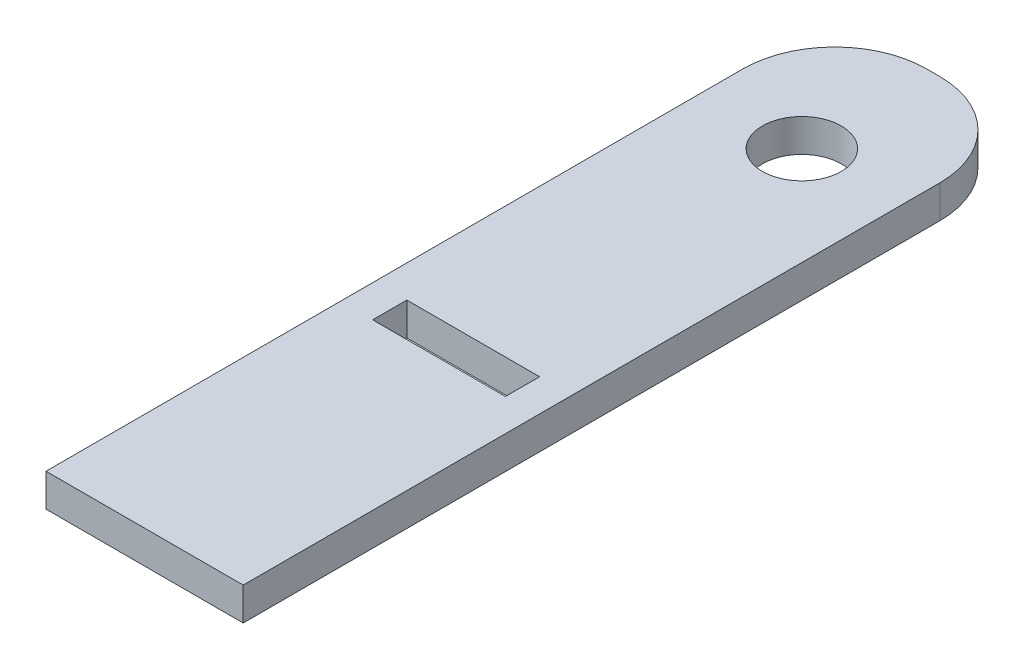
ISO-10303-21;
HEADER;
FILE_DESCRIPTION(('STEP AP214'),'2;1');
FILE_NAME('part.step','',(''),(''),'','','');
FILE_SCHEMA(('AUTOMOTIVE_DESIGN { 1 0 10303 214 1 1 1 1 }'));
ENDSEC;
DATA;
#1=APPLICATION_CONTEXT('core data for automotive mechanical design processes');
#2=APPLICATION_PROTOCOL_DEFINITION('international standard','automotive_design',2000,#1);
#3=PRODUCT_CONTEXT('',#1,'mechanical');
#4=PRODUCT('Part','Part','',(#3));
#5=PRODUCT_RELATED_PRODUCT_CATEGORY('part','',(#4));
#6=PRODUCT_DEFINITION_FORMATION('','',#4);
#7=PRODUCT_DEFINITION_CONTEXT('part definition',#1,'design');
#8=PRODUCT_DEFINITION('design','',#6,#7);
#9=PRODUCT_DEFINITION_SHAPE('','',#8);
#10=(LENGTH_UNIT() NAMED_UNIT(*) SI_UNIT(.MILLI.,.METRE.));
#11=(NAMED_UNIT(*) PLANE_ANGLE_UNIT() SI_UNIT($,.RADIAN.));
#12=(NAMED_UNIT(*) SI_UNIT($,.STERADIAN.) SOLID_ANGLE_UNIT());
#13=UNCERTAINTY_MEASURE_WITH_UNIT(LENGTH_MEASURE(1.E-05),#10,'distance_accuracy_value','');
#14=(GEOMETRIC_REPRESENTATION_CONTEXT(3) GLOBAL_UNCERTAINTY_ASSIGNED_CONTEXT((#13)) GLOBAL_UNIT_ASSIGNED_CONTEXT((#10,
#11,#12)) REPRESENTATION_CONTEXT('',''));
#15=CARTESIAN_POINT('',(0.,0.,0.));
#16=DIRECTION('',(0.,0.,1.));
#17=DIRECTION('',(1.,0.,0.));
#18=AXIS2_PLACEMENT_3D('',#15,#16,#17);
#19=CARTESIAN_POINT('',(-0.635,3.175,-29.21));
#20=DIRECTION('',(0.,1.,0.));
#21=DIRECTION('',(0.,0.,1.));
#22=AXIS2_PLACEMENT_3D('',#19,#20,#21);
#23=CYLINDRICAL_SURFACE('',#22,8.89);
#24=DIRECTION('',(0.,1.,0.));
#25=VECTOR('',#24,1.);
#26=CARTESIAN_POINT('',(-0.635,3.175,-38.1));
#27=LINE('',#26,#25);
#28=CARTESIAN_POINT('',(-0.635000000000004,0.,-38.1));
#29=VERTEX_POINT('',#28);
#30=CARTESIAN_POINT('',(-0.635000000000004,3.175,-38.1));
#31=VERTEX_POINT('',#30);
#32=EDGE_CURVE('E189',#29,#31,#27,.T.);
#33=ORIENTED_EDGE('',*,*,#32,.F.);
#34=CARTESIAN_POINT('',(-0.635,0.,-29.21));
#35=DIRECTION('',(0.,1.,0.));
#36=DIRECTION('',(0.,0.,1.));
#37=AXIS2_PLACEMENT_3D('',#34,#35,#36);
#38=CIRCLE('',#37,8.89);
#39=CARTESIAN_POINT('',(-9.525,0.,-29.21));
#40=VERTEX_POINT('',#39);
#41=EDGE_CURVE('E40',#40,#29,#38,.F.);
#42=ORIENTED_EDGE('',*,*,#41,.F.);
#43=DIRECTION('',(0.,1.,0.));
#44=VECTOR('',#43,1.);
#45=CARTESIAN_POINT('',(-9.525,3.175,-29.21));
#46=LINE('',#45,#44);
#47=CARTESIAN_POINT('',(-9.525,3.175,-29.21));
#48=VERTEX_POINT('',#47);
#49=EDGE_CURVE('E192',#48,#40,#46,.F.);
#50=ORIENTED_EDGE('',*,*,#49,.F.);
#51=CARTESIAN_POINT('',(-0.635,3.175,-29.21));
#52=DIRECTION('',(0.,1.,0.));
#53=DIRECTION('',(0.,0.,1.));
#54=AXIS2_PLACEMENT_3D('',#51,#52,#53);
#55=CIRCLE('',#54,8.89);
#56=EDGE_CURVE('E11',#31,#48,#55,.T.);
#57=ORIENTED_EDGE('',*,*,#56,.F.);
#58=EDGE_LOOP('',(#33,#42,#50,#57));
#59=FACE_BOUND('',#58,.T.);
#60=ADVANCED_FACE('F33',(#59),#23,.T.);
#61=CARTESIAN_POINT('',(0.635000000000004,3.175,-29.21));
#62=DIRECTION('',(0.,1.,0.));
#63=DIRECTION('',(0.,0.,1.));
#64=AXIS2_PLACEMENT_3D('',#61,#62,#63);
#65=CYLINDRICAL_SURFACE('',#64,8.89);
#66=DIRECTION('',(0.,1.,0.));
#67=VECTOR('',#66,1.);
#68=CARTESIAN_POINT('',(9.525,3.175,-29.21));
#69=LINE('',#68,#67);
#70=CARTESIAN_POINT('',(9.525,0.,-29.21));
#71=VERTEX_POINT('',#70);
#72=CARTESIAN_POINT('',(9.525,3.175,-29.21));
#73=VERTEX_POINT('',#72);
#74=EDGE_CURVE('E179',#71,#73,#69,.T.);
#75=ORIENTED_EDGE('',*,*,#74,.F.);
#76=CARTESIAN_POINT('',(0.635000000000004,0.,-29.21));
#77=DIRECTION('',(0.,1.,0.));
#78=DIRECTION('',(0.,0.,1.));
#79=AXIS2_PLACEMENT_3D('',#76,#77,#78);
#80=CIRCLE('',#79,8.89);
#81=CARTESIAN_POINT('',(0.635,0.,-38.1));
#82=VERTEX_POINT('',#81);
#83=EDGE_CURVE('E185',#82,#71,#80,.F.);
#84=ORIENTED_EDGE('',*,*,#83,.F.);
#85=DIRECTION('',(0.,1.,0.));
#86=VECTOR('',#85,1.);
#87=CARTESIAN_POINT('',(0.635000000000004,3.175,-38.1));
#88=LINE('',#87,#86);
#89=CARTESIAN_POINT('',(0.635,3.175,-38.1));
#90=VERTEX_POINT('',#89);
#91=EDGE_CURVE('E182',#90,#82,#88,.F.);
#92=ORIENTED_EDGE('',*,*,#91,.F.);
#93=CARTESIAN_POINT('',(0.635000000000004,3.175,-29.21));
#94=DIRECTION('',(0.,1.,0.));
#95=DIRECTION('',(0.,0.,1.));
#96=AXIS2_PLACEMENT_3D('',#93,#94,#95);
#97=CIRCLE('',#96,8.89);
#98=EDGE_CURVE('E187',#73,#90,#97,.T.);
#99=ORIENTED_EDGE('',*,*,#98,.F.);
#100=EDGE_LOOP('',(#75,#84,#92,#99));
#101=FACE_BOUND('',#100,.T.);
#102=ADVANCED_FACE('F205',(#101),#65,.T.);
#103=CARTESIAN_POINT('',(0.,3.175,0.));
#104=DIRECTION('',(0.,1.,0.));
#105=DIRECTION('',(0.,0.,1.));
#106=AXIS2_PLACEMENT_3D('',#103,#104,#105);
#107=PLANE('',#106);
#108=CARTESIAN_POINT('',(0.,3.175,-25.4));
#109=DIRECTION('',(0.,1.,0.));
#110=DIRECTION('',(0.,0.,1.));
#111=AXIS2_PLACEMENT_3D('',#108,#109,#110);
#112=CIRCLE('',#111,3.81);
#113=CARTESIAN_POINT('',(0.,3.175,-21.59));
#114=VERTEX_POINT('',#113);
#115=EDGE_CURVE('E149',#114,#114,#112,.T.);
#116=ORIENTED_EDGE('',*,*,#115,.F.);
#117=EDGE_LOOP('',(#116));
#118=FACE_BOUND('',#117,.T.);
#119=DIRECTION('',(-1.,0.,0.));
#120=VECTOR('',#119,1.);
#121=CARTESIAN_POINT('',(-9.525,3.175,-38.1));
#122=LINE('',#121,#120);
#123=EDGE_CURVE('E163',#90,#31,#122,.T.);
#124=ORIENTED_EDGE('',*,*,#123,.T.);
#125=ORIENTED_EDGE('',*,*,#56,.T.);
#126=DIRECTION('',(0.,0.,1.));
#127=VECTOR('',#126,1.);
#128=CARTESIAN_POINT('',(-9.525,3.175,-38.1));
#129=LINE('',#128,#127);
#130=CARTESIAN_POINT('',(-9.525,3.175,38.1));
#131=VERTEX_POINT('',#130);
#132=EDGE_CURVE('E155',#48,#131,#129,.T.);
#133=ORIENTED_EDGE('',*,*,#132,.T.);
#134=DIRECTION('',(1.,0.,0.));
#135=VECTOR('',#134,1.);
#136=CARTESIAN_POINT('',(-9.525,3.175,38.1));
#137=LINE('',#136,#135);
#138=CARTESIAN_POINT('',(9.525,3.175,38.1));
#139=VERTEX_POINT('',#138);
#140=EDGE_CURVE('E157',#131,#139,#137,.T.);
#141=ORIENTED_EDGE('',*,*,#140,.T.);
#142=DIRECTION('',(0.,0.,-1.));
#143=VECTOR('',#142,1.);
#144=CARTESIAN_POINT('',(9.525,3.175,-38.1));
#145=LINE('',#144,#143);
#146=EDGE_CURVE('E160',#139,#73,#145,.T.);
#147=ORIENTED_EDGE('',*,*,#146,.T.);
#148=ORIENTED_EDGE('',*,*,#98,.T.);
#149=EDGE_LOOP('',(#124,#125,#133,#141,#147,#148));
#150=FACE_BOUND('',#149,.T.);
#151=DIRECTION('',(1.,0.,0.));
#152=VECTOR('',#151,1.);
#153=CARTESIAN_POINT('',(-6.4135,3.175,9.652));
#154=LINE('',#153,#152);
#155=CARTESIAN_POINT('',(-6.4135,3.175,9.652));
#156=VERTEX_POINT('',#155);
#157=CARTESIAN_POINT('',(6.4135,3.175,9.652));
#158=VERTEX_POINT('',#157);
#159=EDGE_CURVE('E117',#156,#158,#154,.T.);
#160=ORIENTED_EDGE('',*,*,#159,.F.);
#161=DIRECTION('',(0.,0.,1.));
#162=VECTOR('',#161,1.);
#163=CARTESIAN_POINT('',(-6.4135,3.175,6.35));
#164=LINE('',#163,#162);
#165=CARTESIAN_POINT('',(-6.4135,3.175,6.35));
#166=VERTEX_POINT('',#165);
#167=EDGE_CURVE('E107',#166,#156,#164,.T.);
#168=ORIENTED_EDGE('',*,*,#167,.F.);
#169=DIRECTION('',(-1.,0.,0.));
#170=VECTOR('',#169,1.);
#171=CARTESIAN_POINT('',(-6.4135,3.175,6.35));
#172=LINE('',#171,#170);
#173=CARTESIAN_POINT('',(6.4135,3.175,6.35));
#174=VERTEX_POINT('',#173);
#175=EDGE_CURVE('E133',#174,#166,#172,.T.);
#176=ORIENTED_EDGE('',*,*,#175,.F.);
#177=DIRECTION('',(0.,0.,-1.));
#178=VECTOR('',#177,1.);
#179=CARTESIAN_POINT('',(6.4135,3.175,6.35));
#180=LINE('',#179,#178);
#181=EDGE_CURVE('E131',#158,#174,#180,.T.);
#182=ORIENTED_EDGE('',*,*,#181,.F.);
#183=EDGE_LOOP('',(#160,#168,#176,#182));
#184=FACE_BOUND('',#183,.T.);
#185=ADVANCED_FACE('F129',(#118,#150,#184),#107,.T.);
#186=CARTESIAN_POINT('',(0.,0.,0.));
#187=DIRECTION('',(0.,1.,0.));
#188=DIRECTION('',(0.,0.,1.));
#189=AXIS2_PLACEMENT_3D('',#186,#187,#188);
#190=PLANE('',#189);
#191=CARTESIAN_POINT('',(0.,0.,-25.4));
#192=DIRECTION('',(0.,1.,0.));
#193=DIRECTION('',(0.,0.,1.));
#194=AXIS2_PLACEMENT_3D('',#191,#192,#193);
#195=CIRCLE('',#194,3.81);
#196=CARTESIAN_POINT('',(0.,0.,-21.59));
#197=VERTEX_POINT('',#196);
#198=EDGE_CURVE('E125',#197,#197,#195,.T.);
#199=ORIENTED_EDGE('',*,*,#198,.T.);
#200=EDGE_LOOP('',(#199));
#201=FACE_BOUND('',#200,.T.);
#202=DIRECTION('',(0.,0.,1.));
#203=VECTOR('',#202,1.);
#204=CARTESIAN_POINT('',(-9.525,0.,-38.1));
#205=LINE('',#204,#203);
#206=CARTESIAN_POINT('',(-9.525,0.,38.1));
#207=VERTEX_POINT('',#206);
#208=EDGE_CURVE('E152',#40,#207,#205,.T.);
#209=ORIENTED_EDGE('',*,*,#208,.F.);
#210=ORIENTED_EDGE('',*,*,#41,.T.);
#211=DIRECTION('',(-1.,0.,0.));
#212=VECTOR('',#211,1.);
#213=CARTESIAN_POINT('',(-9.525,0.,-38.1));
#214=LINE('',#213,#212);
#215=EDGE_CURVE('E158',#82,#29,#214,.T.);
#216=ORIENTED_EDGE('',*,*,#215,.F.);
#217=ORIENTED_EDGE('',*,*,#83,.T.);
#218=DIRECTION('',(0.,0.,-1.));
#219=VECTOR('',#218,1.);
#220=CARTESIAN_POINT('',(9.525,0.,-38.1));
#221=LINE('',#220,#219);
#222=CARTESIAN_POINT('',(9.525,0.,38.1));
#223=VERTEX_POINT('',#222);
#224=EDGE_CURVE('E169',#223,#71,#221,.T.);
#225=ORIENTED_EDGE('',*,*,#224,.F.);
#226=DIRECTION('',(1.,0.,0.));
#227=VECTOR('',#226,1.);
#228=CARTESIAN_POINT('',(-9.525,0.,38.1));
#229=LINE('',#228,#227);
#230=EDGE_CURVE('E167',#207,#223,#229,.T.);
#231=ORIENTED_EDGE('',*,*,#230,.F.);
#232=EDGE_LOOP('',(#209,#210,#216,#217,#225,#231));
#233=FACE_BOUND('',#232,.T.);
#234=DIRECTION('',(0.,0.,1.));
#235=VECTOR('',#234,1.);
#236=CARTESIAN_POINT('',(-6.4135,0.,6.35));
#237=LINE('',#236,#235);
#238=CARTESIAN_POINT('',(-6.4135,0.,6.35));
#239=VERTEX_POINT('',#238);
#240=CARTESIAN_POINT('',(-6.4135,0.,9.652));
#241=VERTEX_POINT('',#240);
#242=EDGE_CURVE('E137',#239,#241,#237,.T.);
#243=ORIENTED_EDGE('',*,*,#242,.T.);
#244=DIRECTION('',(1.,0.,0.));
#245=VECTOR('',#244,1.);
#246=CARTESIAN_POINT('',(-6.4135,0.,9.652));
#247=LINE('',#246,#245);
#248=CARTESIAN_POINT('',(6.4135,0.,9.652));
#249=VERTEX_POINT('',#248);
#250=EDGE_CURVE('E124',#241,#249,#247,.T.);
#251=ORIENTED_EDGE('',*,*,#250,.T.);
#252=DIRECTION('',(0.,0.,-1.));
#253=VECTOR('',#252,1.);
#254=CARTESIAN_POINT('',(6.4135,0.,6.35));
#255=LINE('',#254,#253);
#256=CARTESIAN_POINT('',(6.4135,0.,6.35));
#257=VERTEX_POINT('',#256);
#258=EDGE_CURVE('E140',#249,#257,#255,.T.);
#259=ORIENTED_EDGE('',*,*,#258,.T.);
#260=DIRECTION('',(-1.,0.,0.));
#261=VECTOR('',#260,1.);
#262=CARTESIAN_POINT('',(-6.4135,0.,6.35));
#263=LINE('',#262,#261);
#264=EDGE_CURVE('E118',#257,#239,#263,.T.);
#265=ORIENTED_EDGE('',*,*,#264,.T.);
#266=EDGE_LOOP('',(#243,#251,#259,#265));
#267=FACE_BOUND('',#266,.T.);
#268=ADVANCED_FACE('F196',(#201,#233,#267),#190,.F.);
#269=CARTESIAN_POINT('',(-9.525,3.175,-38.1));
#270=DIRECTION('',(1.,0.,0.));
#271=DIRECTION('',(0.,0.,-1.));
#272=AXIS2_PLACEMENT_3D('',#269,#270,#271);
#273=PLANE('',#272);
#274=ORIENTED_EDGE('',*,*,#132,.F.);
#275=ORIENTED_EDGE('',*,*,#49,.T.);
#276=ORIENTED_EDGE('',*,*,#208,.T.);
#277=DIRECTION('',(0.,-1.,0.));
#278=VECTOR('',#277,1.);
#279=CARTESIAN_POINT('',(-9.525,3.175,38.1));
#280=LINE('',#279,#278);
#281=EDGE_CURVE('E176',#131,#207,#280,.T.);
#282=ORIENTED_EDGE('',*,*,#281,.F.);
#283=EDGE_LOOP('',(#274,#275,#276,#282));
#284=FACE_BOUND('',#283,.T.);
#285=ADVANCED_FACE('F217',(#284),#273,.F.);
#286=CARTESIAN_POINT('',(-9.525,3.175,38.1));
#287=DIRECTION('',(0.,0.,-1.));
#288=DIRECTION('',(-1.,0.,0.));
#289=AXIS2_PLACEMENT_3D('',#286,#287,#288);
#290=PLANE('',#289);
#291=ORIENTED_EDGE('',*,*,#230,.T.);
#292=DIRECTION('',(0.,-1.,0.));
#293=VECTOR('',#292,1.);
#294=CARTESIAN_POINT('',(9.525,3.175,38.1));
#295=LINE('',#294,#293);
#296=EDGE_CURVE('E165',#139,#223,#295,.T.);
#297=ORIENTED_EDGE('',*,*,#296,.F.);
#298=ORIENTED_EDGE('',*,*,#140,.F.);
#299=ORIENTED_EDGE('',*,*,#281,.T.);
#300=EDGE_LOOP('',(#291,#297,#298,#299));
#301=FACE_BOUND('',#300,.T.);
#302=ADVANCED_FACE('F213',(#301),#290,.F.);
#303=CARTESIAN_POINT('',(9.525,3.175,-38.1));
#304=DIRECTION('',(-1.,0.,0.));
#305=DIRECTION('',(0.,0.,1.));
#306=AXIS2_PLACEMENT_3D('',#303,#304,#305);
#307=PLANE('',#306);
#308=ORIENTED_EDGE('',*,*,#224,.T.);
#309=ORIENTED_EDGE('',*,*,#74,.T.);
#310=ORIENTED_EDGE('',*,*,#146,.F.);
#311=ORIENTED_EDGE('',*,*,#296,.T.);
#312=EDGE_LOOP('',(#308,#309,#310,#311));
#313=FACE_BOUND('',#312,.T.);
#314=ADVANCED_FACE('F208',(#313),#307,.F.);
#315=CARTESIAN_POINT('',(-9.525,3.175,-38.1));
#316=DIRECTION('',(0.,0.,1.));
#317=DIRECTION('',(1.,0.,0.));
#318=AXIS2_PLACEMENT_3D('',#315,#316,#317);
#319=PLANE('',#318);
#320=ORIENTED_EDGE('',*,*,#215,.T.);
#321=ORIENTED_EDGE('',*,*,#32,.T.);
#322=ORIENTED_EDGE('',*,*,#123,.F.);
#323=ORIENTED_EDGE('',*,*,#91,.T.);
#324=EDGE_LOOP('',(#320,#321,#322,#323));
#325=FACE_BOUND('',#324,.T.);
#326=ADVANCED_FACE('F201',(#325),#319,.F.);
#327=CARTESIAN_POINT('',(0.,3.175,-25.4));
#328=DIRECTION('',(0.,-1.,0.));
#329=DIRECTION('',(0.,0.,-1.));
#330=AXIS2_PLACEMENT_3D('',#327,#328,#329);
#331=CYLINDRICAL_SURFACE('',#330,3.81);
#332=ORIENTED_EDGE('',*,*,#115,.T.);
#333=EDGE_LOOP('',(#332));
#334=FACE_BOUND('',#333,.T.);
#335=ORIENTED_EDGE('',*,*,#198,.F.);
#336=EDGE_LOOP('',(#335));
#337=FACE_BOUND('',#336,.T.);
#338=ADVANCED_FACE('F264',(#334,#337),#331,.F.);
#339=CARTESIAN_POINT('',(-6.4135,3.175,6.35));
#340=DIRECTION('',(1.,0.,0.));
#341=DIRECTION('',(0.,0.,-1.));
#342=AXIS2_PLACEMENT_3D('',#339,#340,#341);
#343=PLANE('',#342);
#344=ORIENTED_EDGE('',*,*,#242,.F.);
#345=DIRECTION('',(0.,-1.,0.));
#346=VECTOR('',#345,1.);
#347=CARTESIAN_POINT('',(-6.4135,3.175,6.35));
#348=LINE('',#347,#346);
#349=EDGE_CURVE('E113',#166,#239,#348,.T.);
#350=ORIENTED_EDGE('',*,*,#349,.F.);
#351=ORIENTED_EDGE('',*,*,#167,.T.);
#352=DIRECTION('',(0.,-1.,0.));
#353=VECTOR('',#352,1.);
#354=CARTESIAN_POINT('',(-6.4135,3.175,9.652));
#355=LINE('',#354,#353);
#356=EDGE_CURVE('E110',#156,#241,#355,.T.);
#357=ORIENTED_EDGE('',*,*,#356,.T.);
#358=EDGE_LOOP('',(#344,#350,#351,#357));
#359=FACE_BOUND('',#358,.T.);
#360=ADVANCED_FACE('F109',(#359),#343,.T.);
#361=CARTESIAN_POINT('',(-6.4135,3.175,9.652));
#362=DIRECTION('',(0.,0.,-1.));
#363=DIRECTION('',(-1.,0.,0.));
#364=AXIS2_PLACEMENT_3D('',#361,#362,#363);
#365=PLANE('',#364);
#366=ORIENTED_EDGE('',*,*,#250,.F.);
#367=ORIENTED_EDGE('',*,*,#356,.F.);
#368=ORIENTED_EDGE('',*,*,#159,.T.);
#369=DIRECTION('',(0.,-1.,0.));
#370=VECTOR('',#369,1.);
#371=CARTESIAN_POINT('',(6.4135,3.175,9.652));
#372=LINE('',#371,#370);
#373=EDGE_CURVE('E126',#158,#249,#372,.T.);
#374=ORIENTED_EDGE('',*,*,#373,.T.);
#375=EDGE_LOOP('',(#366,#367,#368,#374));
#376=FACE_BOUND('',#375,.T.);
#377=ADVANCED_FACE('F121',(#376),#365,.T.);
#378=CARTESIAN_POINT('',(6.4135,3.175,6.35));
#379=DIRECTION('',(-1.,0.,0.));
#380=DIRECTION('',(0.,0.,1.));
#381=AXIS2_PLACEMENT_3D('',#378,#379,#380);
#382=PLANE('',#381);
#383=ORIENTED_EDGE('',*,*,#258,.F.);
#384=ORIENTED_EDGE('',*,*,#373,.F.);
#385=ORIENTED_EDGE('',*,*,#181,.T.);
#386=DIRECTION('',(0.,-1.,0.));
#387=VECTOR('',#386,1.);
#388=CARTESIAN_POINT('',(6.4135,3.175,6.35));
#389=LINE('',#388,#387);
#390=EDGE_CURVE('E146',#174,#257,#389,.T.);
#391=ORIENTED_EDGE('',*,*,#390,.T.);
#392=EDGE_LOOP('',(#383,#384,#385,#391));
#393=FACE_BOUND('',#392,.T.);
#394=ADVANCED_FACE('F283',(#393),#382,.T.);
#395=CARTESIAN_POINT('',(-6.4135,3.175,6.35));
#396=DIRECTION('',(0.,0.,1.));
#397=DIRECTION('',(1.,0.,0.));
#398=AXIS2_PLACEMENT_3D('',#395,#396,#397);
#399=PLANE('',#398);
#400=ORIENTED_EDGE('',*,*,#264,.F.);
#401=ORIENTED_EDGE('',*,*,#390,.F.);
#402=ORIENTED_EDGE('',*,*,#175,.T.);
#403=ORIENTED_EDGE('',*,*,#349,.T.);
#404=EDGE_LOOP('',(#400,#401,#402,#403));
#405=FACE_BOUND('',#404,.T.);
#406=ADVANCED_FACE('F243',(#405),#399,.T.);
#407=CLOSED_SHELL('',(#60,#102,#185,#268,#285,#302,#314,#326,#338,#360,#377,#394,#406));
#408=MANIFOLD_SOLID_BREP('B2',#407);
#409=ADVANCED_BREP_SHAPE_REPRESENTATION('',(#18,#408),#14);
#410=SHAPE_DEFINITION_REPRESENTATION(#9,#409);
ENDSEC;
END-ISO-10303-21;
